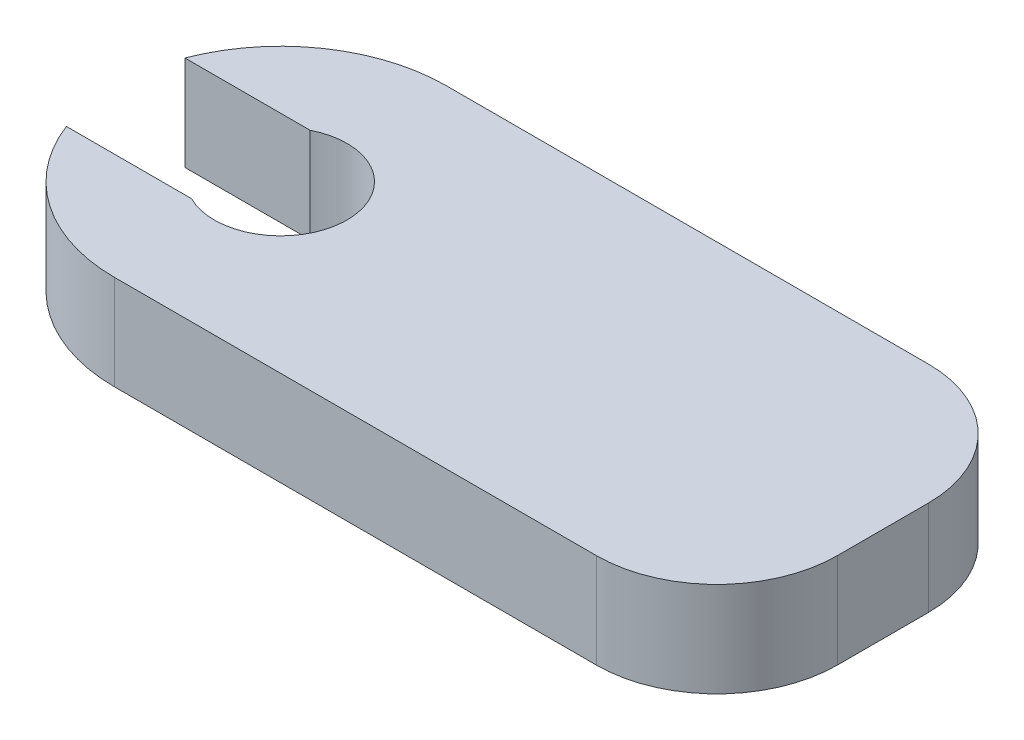
ISO-10303-21;
HEADER;
FILE_DESCRIPTION(('STEP AP214'),'2;1');
FILE_NAME('part.step','',(''),(''),'','','');
FILE_SCHEMA(('AUTOMOTIVE_DESIGN { 1 0 10303 214 1 1 1 1 }'));
ENDSEC;
DATA;
#1=APPLICATION_CONTEXT('core data for automotive mechanical design processes');
#2=APPLICATION_PROTOCOL_DEFINITION('international standard','automotive_design',2000,#1);
#3=PRODUCT_CONTEXT('',#1,'mechanical');
#4=PRODUCT('Part','Part','',(#3));
#5=PRODUCT_RELATED_PRODUCT_CATEGORY('part','',(#4));
#6=PRODUCT_DEFINITION_FORMATION('','',#4);
#7=PRODUCT_DEFINITION_CONTEXT('part definition',#1,'design');
#8=PRODUCT_DEFINITION('design','',#6,#7);
#9=PRODUCT_DEFINITION_SHAPE('','',#8);
#10=(LENGTH_UNIT() NAMED_UNIT(*) SI_UNIT(.MILLI.,.METRE.));
#11=(NAMED_UNIT(*) PLANE_ANGLE_UNIT() SI_UNIT($,.RADIAN.));
#12=(NAMED_UNIT(*) SI_UNIT($,.STERADIAN.) SOLID_ANGLE_UNIT());
#13=UNCERTAINTY_MEASURE_WITH_UNIT(LENGTH_MEASURE(1.E-05),#10,'distance_accuracy_value','');
#14=(GEOMETRIC_REPRESENTATION_CONTEXT(3) GLOBAL_UNCERTAINTY_ASSIGNED_CONTEXT((#13)) GLOBAL_UNIT_ASSIGNED_CONTEXT((#10,
#11,#12)) REPRESENTATION_CONTEXT('',''));
#15=CARTESIAN_POINT('',(0.,0.,0.));
#16=DIRECTION('',(0.,0.,1.));
#17=DIRECTION('',(1.,0.,0.));
#18=AXIS2_PLACEMENT_3D('',#15,#16,#17);
#19=CARTESIAN_POINT('',(0.,2.,0.));
#20=DIRECTION('',(0.,-1.,0.));
#21=DIRECTION('',(0.,0.,-1.));
#22=AXIS2_PLACEMENT_3D('',#19,#20,#21);
#23=CYLINDRICAL_SURFACE('',#22,3.5);
#24=CARTESIAN_POINT('',(0.,0.,0.));
#25=DIRECTION('',(0.,1.,0.));
#26=DIRECTION('',(0.,0.,1.));
#27=AXIS2_PLACEMENT_3D('',#24,#25,#26);
#28=CIRCLE('',#27,3.5);
#29=CARTESIAN_POINT('',(-3.2691751635533,0.,1.2499975));
#30=VERTEX_POINT('',#29);
#31=CARTESIAN_POINT('',(0.,0.,3.5));
#32=VERTEX_POINT('',#31);
#33=EDGE_CURVE('E145',#30,#32,#28,.T.);
#34=ORIENTED_EDGE('',*,*,#33,.T.);
#35=DIRECTION('',(0.,-1.,0.));
#36=VECTOR('',#35,1.);
#37=CARTESIAN_POINT('',(0.,2.,3.5));
#38=LINE('',#37,#36);
#39=CARTESIAN_POINT('',(0.,2.,3.5));
#40=VERTEX_POINT('',#39);
#41=EDGE_CURVE('E11',#40,#32,#38,.T.);
#42=ORIENTED_EDGE('',*,*,#41,.F.);
#43=CARTESIAN_POINT('',(0.,2.,0.));
#44=DIRECTION('',(0.,1.,0.));
#45=DIRECTION('',(0.,0.,1.));
#46=AXIS2_PLACEMENT_3D('',#43,#44,#45);
#47=CIRCLE('',#46,3.5);
#48=CARTESIAN_POINT('',(-3.2691751635533,2.,1.2499975));
#49=VERTEX_POINT('',#48);
#50=EDGE_CURVE('E96',#49,#40,#47,.T.);
#51=ORIENTED_EDGE('',*,*,#50,.F.);
#52=DIRECTION('',(0.,-1.,0.));
#53=VECTOR('',#52,1.);
#54=CARTESIAN_POINT('',(-3.2691751635533,2.,1.2499975));
#55=LINE('',#54,#53);
#56=EDGE_CURVE('E53',#49,#30,#55,.T.);
#57=ORIENTED_EDGE('',*,*,#56,.T.);
#58=EDGE_LOOP('',(#34,#42,#51,#57));
#59=FACE_BOUND('',#58,.T.);
#60=ADVANCED_FACE('F36',(#59),#23,.T.);
#61=CARTESIAN_POINT('',(0.,2.,3.5));
#62=DIRECTION('',(0.,0.,1.));
#63=DIRECTION('',(1.,0.,0.));
#64=AXIS2_PLACEMENT_3D('',#61,#62,#63);
#65=PLANE('',#64);
#66=DIRECTION('',(-1.,0.,0.));
#67=VECTOR('',#66,1.);
#68=CARTESIAN_POINT('',(0.,0.,3.5));
#69=LINE('',#68,#67);
#70=CARTESIAN_POINT('',(10.16,0.,3.5));
#71=VERTEX_POINT('',#70);
#72=EDGE_CURVE('E147',#71,#32,#69,.T.);
#73=ORIENTED_EDGE('',*,*,#72,.F.);
#74=DIRECTION('',(0.,-1.,0.));
#75=VECTOR('',#74,1.);
#76=CARTESIAN_POINT('',(10.16,2.,3.5));
#77=LINE('',#76,#75);
#78=CARTESIAN_POINT('',(10.16,2.,3.5));
#79=VERTEX_POINT('',#78);
#80=EDGE_CURVE('E45',#79,#71,#77,.T.);
#81=ORIENTED_EDGE('',*,*,#80,.F.);
#82=DIRECTION('',(-1.,0.,0.));
#83=VECTOR('',#82,1.);
#84=CARTESIAN_POINT('',(0.,2.,3.5));
#85=LINE('',#84,#83);
#86=EDGE_CURVE('E199',#79,#40,#85,.T.);
#87=ORIENTED_EDGE('',*,*,#86,.T.);
#88=ORIENTED_EDGE('',*,*,#41,.T.);
#89=EDGE_LOOP('',(#73,#81,#87,#88));
#90=FACE_BOUND('',#89,.T.);
#91=ADVANCED_FACE('F38',(#90),#65,.T.);
#92=CARTESIAN_POINT('',(10.16,2.,0.959999999999999));
#93=DIRECTION('',(0.,-1.,0.));
#94=DIRECTION('',(0.,0.,-1.));
#95=AXIS2_PLACEMENT_3D('',#92,#93,#94);
#96=CYLINDRICAL_SURFACE('',#95,2.54);
#97=CARTESIAN_POINT('',(10.16,0.,0.959999999999999));
#98=DIRECTION('',(0.,1.,0.));
#99=DIRECTION('',(0.,0.,1.));
#100=AXIS2_PLACEMENT_3D('',#97,#98,#99);
#101=CIRCLE('',#100,2.54);
#102=CARTESIAN_POINT('',(12.7,0.,0.959999999999998));
#103=VERTEX_POINT('',#102);
#104=EDGE_CURVE('E151',#103,#71,#101,.F.);
#105=ORIENTED_EDGE('',*,*,#104,.F.);
#106=DIRECTION('',(0.,-1.,0.));
#107=VECTOR('',#106,1.);
#108=CARTESIAN_POINT('',(12.7,2.,0.959999999999998));
#109=LINE('',#108,#107);
#110=CARTESIAN_POINT('',(12.7,2.,0.959999999999998));
#111=VERTEX_POINT('',#110);
#112=EDGE_CURVE('E178',#111,#103,#109,.T.);
#113=ORIENTED_EDGE('',*,*,#112,.F.);
#114=CARTESIAN_POINT('',(10.16,2.,0.959999999999999));
#115=DIRECTION('',(0.,1.,0.));
#116=DIRECTION('',(0.,0.,1.));
#117=AXIS2_PLACEMENT_3D('',#114,#115,#116);
#118=CIRCLE('',#117,2.54);
#119=EDGE_CURVE('E185',#111,#79,#118,.F.);
#120=ORIENTED_EDGE('',*,*,#119,.T.);
#121=ORIENTED_EDGE('',*,*,#80,.T.);
#122=EDGE_LOOP('',(#105,#113,#120,#121));
#123=FACE_BOUND('',#122,.T.);
#124=ADVANCED_FACE('F183',(#123),#96,.T.);
#125=CARTESIAN_POINT('',(12.7,2.,0.));
#126=DIRECTION('',(1.,0.,0.));
#127=DIRECTION('',(0.,0.,-1.));
#128=AXIS2_PLACEMENT_3D('',#125,#126,#127);
#129=PLANE('',#128);
#130=DIRECTION('',(0.,0.,1.));
#131=VECTOR('',#130,1.);
#132=CARTESIAN_POINT('',(12.7,0.,0.));
#133=LINE('',#132,#131);
#134=CARTESIAN_POINT('',(12.7,0.,-0.959999999999998));
#135=VERTEX_POINT('',#134);
#136=EDGE_CURVE('E154',#135,#103,#133,.T.);
#137=ORIENTED_EDGE('',*,*,#136,.F.);
#138=DIRECTION('',(0.,-1.,0.));
#139=VECTOR('',#138,1.);
#140=CARTESIAN_POINT('',(12.7,2.,-0.959999999999998));
#141=LINE('',#140,#139);
#142=CARTESIAN_POINT('',(12.7,2.,-0.959999999999998));
#143=VERTEX_POINT('',#142);
#144=EDGE_CURVE('E176',#143,#135,#141,.T.);
#145=ORIENTED_EDGE('',*,*,#144,.F.);
#146=DIRECTION('',(0.,0.,1.));
#147=VECTOR('',#146,1.);
#148=CARTESIAN_POINT('',(12.7,2.,0.));
#149=LINE('',#148,#147);
#150=EDGE_CURVE('E196',#143,#111,#149,.T.);
#151=ORIENTED_EDGE('',*,*,#150,.T.);
#152=ORIENTED_EDGE('',*,*,#112,.T.);
#153=EDGE_LOOP('',(#137,#145,#151,#152));
#154=FACE_BOUND('',#153,.T.);
#155=ADVANCED_FACE('F193',(#154),#129,.T.);
#156=CARTESIAN_POINT('',(10.16,2.,-0.959999999999999));
#157=DIRECTION('',(0.,-1.,0.));
#158=DIRECTION('',(0.,0.,-1.));
#159=AXIS2_PLACEMENT_3D('',#156,#157,#158);
#160=CYLINDRICAL_SURFACE('',#159,2.54);
#161=CARTESIAN_POINT('',(10.16,0.,-0.959999999999999));
#162=DIRECTION('',(0.,1.,0.));
#163=DIRECTION('',(0.,0.,1.));
#164=AXIS2_PLACEMENT_3D('',#161,#162,#163);
#165=CIRCLE('',#164,2.54);
#166=CARTESIAN_POINT('',(10.16,0.,-3.5));
#167=VERTEX_POINT('',#166);
#168=EDGE_CURVE('E157',#167,#135,#165,.F.);
#169=ORIENTED_EDGE('',*,*,#168,.F.);
#170=DIRECTION('',(0.,-1.,0.));
#171=VECTOR('',#170,1.);
#172=CARTESIAN_POINT('',(10.16,2.,-3.5));
#173=LINE('',#172,#171);
#174=CARTESIAN_POINT('',(10.16,2.,-3.5));
#175=VERTEX_POINT('',#174);
#176=EDGE_CURVE('E174',#175,#167,#173,.T.);
#177=ORIENTED_EDGE('',*,*,#176,.F.);
#178=CARTESIAN_POINT('',(10.16,2.,-0.959999999999999));
#179=DIRECTION('',(0.,1.,0.));
#180=DIRECTION('',(0.,0.,1.));
#181=AXIS2_PLACEMENT_3D('',#178,#179,#180);
#182=CIRCLE('',#181,2.54);
#183=EDGE_CURVE('E201',#175,#143,#182,.F.);
#184=ORIENTED_EDGE('',*,*,#183,.T.);
#185=ORIENTED_EDGE('',*,*,#144,.T.);
#186=EDGE_LOOP('',(#169,#177,#184,#185));
#187=FACE_BOUND('',#186,.T.);
#188=ADVANCED_FACE('F212',(#187),#160,.T.);
#189=CARTESIAN_POINT('',(0.,2.,-3.5));
#190=DIRECTION('',(0.,0.,-1.));
#191=DIRECTION('',(-1.,0.,0.));
#192=AXIS2_PLACEMENT_3D('',#189,#190,#191);
#193=PLANE('',#192);
#194=DIRECTION('',(1.,0.,0.));
#195=VECTOR('',#194,1.);
#196=CARTESIAN_POINT('',(0.,0.,-3.5));
#197=LINE('',#196,#195);
#198=CARTESIAN_POINT('',(0.,0.,-3.5));
#199=VERTEX_POINT('',#198);
#200=EDGE_CURVE('E160',#199,#167,#197,.T.);
#201=ORIENTED_EDGE('',*,*,#200,.F.);
#202=DIRECTION('',(0.,-1.,0.));
#203=VECTOR('',#202,1.);
#204=CARTESIAN_POINT('',(0.,2.,-3.5));
#205=LINE('',#204,#203);
#206=CARTESIAN_POINT('',(0.,2.,-3.5));
#207=VERTEX_POINT('',#206);
#208=EDGE_CURVE('E172',#207,#199,#205,.T.);
#209=ORIENTED_EDGE('',*,*,#208,.F.);
#210=DIRECTION('',(1.,0.,0.));
#211=VECTOR('',#210,1.);
#212=CARTESIAN_POINT('',(0.,2.,-3.5));
#213=LINE('',#212,#211);
#214=EDGE_CURVE('E206',#207,#175,#213,.T.);
#215=ORIENTED_EDGE('',*,*,#214,.T.);
#216=ORIENTED_EDGE('',*,*,#176,.T.);
#217=EDGE_LOOP('',(#201,#209,#215,#216));
#218=FACE_BOUND('',#217,.T.);
#219=ADVANCED_FACE('F210',(#218),#193,.T.);
#220=CARTESIAN_POINT('',(-3.2691751635533,0.,-1.2499975));
#221=VERTEX_POINT('',#220);
#222=EDGE_CURVE('E148',#199,#221,#28,.T.);
#223=ORIENTED_EDGE('',*,*,#222,.T.);
#224=DIRECTION('',(0.,-1.,0.));
#225=VECTOR('',#224,1.);
#226=CARTESIAN_POINT('',(-3.2691751635533,2.,-1.2499975));
#227=LINE('',#226,#225);
#228=CARTESIAN_POINT('',(-3.2691751635533,2.,-1.2499975));
#229=VERTEX_POINT('',#228);
#230=EDGE_CURVE('E137',#229,#221,#227,.T.);
#231=ORIENTED_EDGE('',*,*,#230,.F.);
#232=EDGE_CURVE('E125',#207,#229,#47,.T.);
#233=ORIENTED_EDGE('',*,*,#232,.F.);
#234=ORIENTED_EDGE('',*,*,#208,.T.);
#235=EDGE_LOOP('',(#223,#231,#233,#234));
#236=FACE_BOUND('',#235,.T.);
#237=ADVANCED_FACE('F215',(#236),#23,.T.);
#238=CARTESIAN_POINT('',(0.,2.,-1.2499975));
#239=DIRECTION('',(0.,0.,-1.));
#240=DIRECTION('',(-1.,0.,0.));
#241=AXIS2_PLACEMENT_3D('',#238,#239,#240);
#242=PLANE('',#241);
#243=DIRECTION('',(1.,0.,0.));
#244=VECTOR('',#243,1.);
#245=CARTESIAN_POINT('',(0.,0.,-1.2499975));
#246=LINE('',#245,#244);
#247=CARTESIAN_POINT('',(-0.630480967193896,0.,-1.2499975));
#248=VERTEX_POINT('',#247);
#249=EDGE_CURVE('E134',#221,#248,#246,.T.);
#250=ORIENTED_EDGE('',*,*,#249,.T.);
#251=DIRECTION('',(0.,-1.,0.));
#252=VECTOR('',#251,1.);
#253=CARTESIAN_POINT('',(-0.630480967193896,2.,-1.2499975));
#254=LINE('',#253,#252);
#255=CARTESIAN_POINT('',(-0.630480967193896,2.,-1.2499975));
#256=VERTEX_POINT('',#255);
#257=EDGE_CURVE('E131',#256,#248,#254,.T.);
#258=ORIENTED_EDGE('',*,*,#257,.F.);
#259=DIRECTION('',(1.,0.,0.));
#260=VECTOR('',#259,1.);
#261=CARTESIAN_POINT('',(0.,2.,-1.2499975));
#262=LINE('',#261,#260);
#263=EDGE_CURVE('E118',#229,#256,#262,.T.);
#264=ORIENTED_EDGE('',*,*,#263,.F.);
#265=ORIENTED_EDGE('',*,*,#230,.T.);
#266=EDGE_LOOP('',(#250,#258,#264,#265));
#267=FACE_BOUND('',#266,.T.);
#268=ADVANCED_FACE('F132',(#267),#242,.F.);
#269=CARTESIAN_POINT('',(0.,2.,0.));
#270=DIRECTION('',(0.,-1.,0.));
#271=DIRECTION('',(0.,0.,-1.));
#272=AXIS2_PLACEMENT_3D('',#269,#270,#271);
#273=CYLINDRICAL_SURFACE('',#272,1.4);
#274=CARTESIAN_POINT('',(0.,0.,0.));
#275=DIRECTION('',(0.,1.,0.));
#276=DIRECTION('',(0.,0.,1.));
#277=AXIS2_PLACEMENT_3D('',#274,#275,#276);
#278=CIRCLE('',#277,1.4);
#279=CARTESIAN_POINT('',(-0.630480967193896,0.,1.2499975));
#280=VERTEX_POINT('',#279);
#281=EDGE_CURVE('E164',#280,#248,#278,.T.);
#282=ORIENTED_EDGE('',*,*,#281,.F.);
#283=DIRECTION('',(0.,-1.,0.));
#284=VECTOR('',#283,1.);
#285=CARTESIAN_POINT('',(-0.630480967193896,2.,1.2499975));
#286=LINE('',#285,#284);
#287=CARTESIAN_POINT('',(-0.630480967193896,2.,1.2499975));
#288=VERTEX_POINT('',#287);
#289=EDGE_CURVE('E84',#288,#280,#286,.T.);
#290=ORIENTED_EDGE('',*,*,#289,.F.);
#291=CARTESIAN_POINT('',(0.,2.,0.));
#292=DIRECTION('',(0.,1.,0.));
#293=DIRECTION('',(0.,0.,1.));
#294=AXIS2_PLACEMENT_3D('',#291,#292,#293);
#295=CIRCLE('',#294,1.4);
#296=EDGE_CURVE('E122',#288,#256,#295,.T.);
#297=ORIENTED_EDGE('',*,*,#296,.T.);
#298=ORIENTED_EDGE('',*,*,#257,.T.);
#299=EDGE_LOOP('',(#282,#290,#297,#298));
#300=FACE_BOUND('',#299,.T.);
#301=ADVANCED_FACE('F139',(#300),#273,.F.);
#302=CARTESIAN_POINT('',(0.,2.,1.2499975));
#303=DIRECTION('',(0.,0.,-1.));
#304=DIRECTION('',(-1.,0.,0.));
#305=AXIS2_PLACEMENT_3D('',#302,#303,#304);
#306=PLANE('',#305);
#307=DIRECTION('',(1.,0.,0.));
#308=VECTOR('',#307,1.);
#309=CARTESIAN_POINT('',(0.,0.,1.2499975));
#310=LINE('',#309,#308);
#311=EDGE_CURVE('E166',#30,#280,#310,.T.);
#312=ORIENTED_EDGE('',*,*,#311,.F.);
#313=ORIENTED_EDGE('',*,*,#56,.F.);
#314=DIRECTION('',(1.,0.,0.));
#315=VECTOR('',#314,1.);
#316=CARTESIAN_POINT('',(0.,2.,1.2499975));
#317=LINE('',#316,#315);
#318=EDGE_CURVE('E140',#49,#288,#317,.T.);
#319=ORIENTED_EDGE('',*,*,#318,.T.);
#320=ORIENTED_EDGE('',*,*,#289,.T.);
#321=EDGE_LOOP('',(#312,#313,#319,#320));
#322=FACE_BOUND('',#321,.T.);
#323=ADVANCED_FACE('F228',(#322),#306,.T.);
#324=CARTESIAN_POINT('',(0.,2.,0.));
#325=DIRECTION('',(0.,1.,0.));
#326=DIRECTION('',(0.,0.,1.));
#327=AXIS2_PLACEMENT_3D('',#324,#325,#326);
#328=PLANE('',#327);
#329=ORIENTED_EDGE('',*,*,#50,.T.);
#330=ORIENTED_EDGE('',*,*,#86,.F.);
#331=ORIENTED_EDGE('',*,*,#119,.F.);
#332=ORIENTED_EDGE('',*,*,#150,.F.);
#333=ORIENTED_EDGE('',*,*,#183,.F.);
#334=ORIENTED_EDGE('',*,*,#214,.F.);
#335=ORIENTED_EDGE('',*,*,#232,.T.);
#336=ORIENTED_EDGE('',*,*,#263,.T.);
#337=ORIENTED_EDGE('',*,*,#296,.F.);
#338=ORIENTED_EDGE('',*,*,#318,.F.);
#339=EDGE_LOOP('',(#329,#330,#331,#332,#333,#334,#335,#336,#337,#338));
#340=FACE_BOUND('',#339,.T.);
#341=ADVANCED_FACE('F120',(#340),#328,.T.);
#342=CARTESIAN_POINT('',(0.,0.,0.));
#343=DIRECTION('',(0.,1.,0.));
#344=DIRECTION('',(0.,0.,1.));
#345=AXIS2_PLACEMENT_3D('',#342,#343,#344);
#346=PLANE('',#345);
#347=ORIENTED_EDGE('',*,*,#33,.F.);
#348=ORIENTED_EDGE('',*,*,#311,.T.);
#349=ORIENTED_EDGE('',*,*,#281,.T.);
#350=ORIENTED_EDGE('',*,*,#249,.F.);
#351=ORIENTED_EDGE('',*,*,#222,.F.);
#352=ORIENTED_EDGE('',*,*,#200,.T.);
#353=ORIENTED_EDGE('',*,*,#168,.T.);
#354=ORIENTED_EDGE('',*,*,#136,.T.);
#355=ORIENTED_EDGE('',*,*,#104,.T.);
#356=ORIENTED_EDGE('',*,*,#72,.T.);
#357=EDGE_LOOP('',(#347,#348,#349,#350,#351,#352,#353,#354,#355,#356));
#358=FACE_BOUND('',#357,.T.);
#359=ADVANCED_FACE('F189',(#358),#346,.F.);
#360=CLOSED_SHELL('',(#60,#91,#124,#155,#188,#219,#237,#268,#301,#323,#341,#359));
#361=MANIFOLD_SOLID_BREP('B2',#360);
#362=ADVANCED_BREP_SHAPE_REPRESENTATION('',(#18,#361),#14);
#363=SHAPE_DEFINITION_REPRESENTATION(#9,#362);
ENDSEC;
END-ISO-10303-21;
